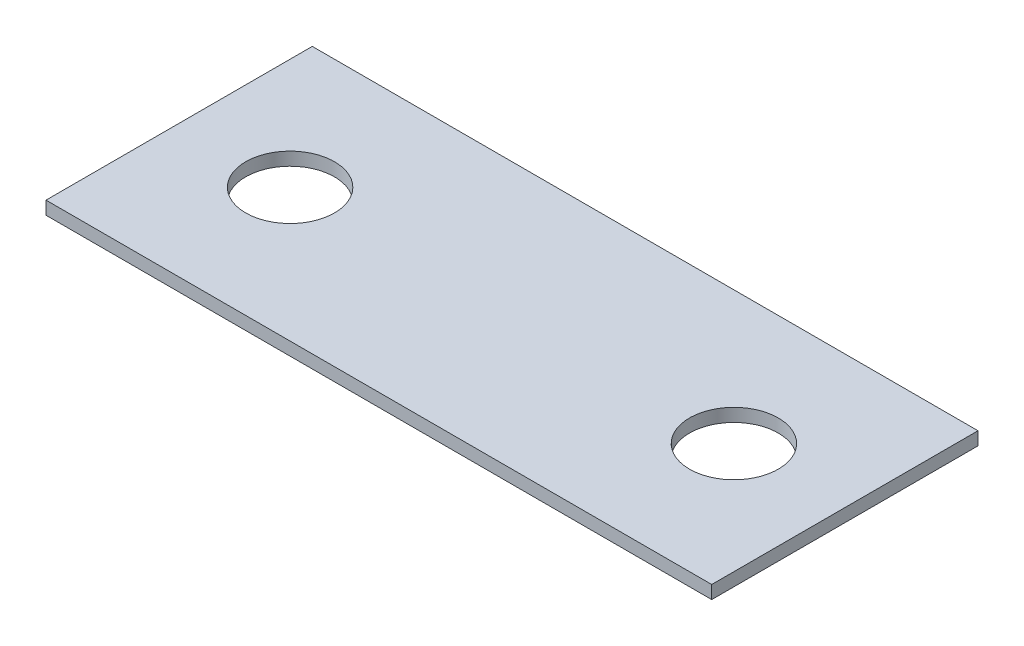
ISO-10303-21;
HEADER;
FILE_DESCRIPTION(('STEP AP214'),'2;1');
FILE_NAME('part.step','',(''),(''),'','','');
FILE_SCHEMA(('AUTOMOTIVE_DESIGN { 1 0 10303 214 1 1 1 1 }'));
ENDSEC;
DATA;
#1=APPLICATION_CONTEXT('core data for automotive mechanical design processes');
#2=APPLICATION_PROTOCOL_DEFINITION('international standard','automotive_design',2000,#1);
#3=PRODUCT_CONTEXT('',#1,'mechanical');
#4=PRODUCT('Part','Part','',(#3));
#5=PRODUCT_RELATED_PRODUCT_CATEGORY('part','',(#4));
#6=PRODUCT_DEFINITION_FORMATION('','',#4);
#7=PRODUCT_DEFINITION_CONTEXT('part definition',#1,'design');
#8=PRODUCT_DEFINITION('design','',#6,#7);
#9=PRODUCT_DEFINITION_SHAPE('','',#8);
#10=(LENGTH_UNIT() NAMED_UNIT(*) SI_UNIT(.MILLI.,.METRE.));
#11=(NAMED_UNIT(*) PLANE_ANGLE_UNIT() SI_UNIT($,.RADIAN.));
#12=(NAMED_UNIT(*) SI_UNIT($,.STERADIAN.) SOLID_ANGLE_UNIT());
#13=UNCERTAINTY_MEASURE_WITH_UNIT(LENGTH_MEASURE(1.E-05),#10,'distance_accuracy_value','');
#14=(GEOMETRIC_REPRESENTATION_CONTEXT(3) GLOBAL_UNCERTAINTY_ASSIGNED_CONTEXT((#13)) GLOBAL_UNIT_ASSIGNED_CONTEXT((#10,
#11,#12)) REPRESENTATION_CONTEXT('',''));
#15=CARTESIAN_POINT('',(0.,0.,0.));
#16=DIRECTION('',(0.,0.,1.));
#17=DIRECTION('',(1.,0.,0.));
#18=AXIS2_PLACEMENT_3D('',#15,#16,#17);
#19=CARTESIAN_POINT('',(0.,0.9375,0.));
#20=DIRECTION('',(1.,0.,0.));
#21=DIRECTION('',(0.,0.,-1.));
#22=AXIS2_PLACEMENT_3D('',#19,#20,#21);
#23=PLANE('',#22);
#24=DIRECTION('',(0.,0.,1.));
#25=VECTOR('',#24,1.);
#26=CARTESIAN_POINT('',(0.,0.,0.));
#27=LINE('',#26,#25);
#28=CARTESIAN_POINT('',(0.,0.,0.));
#29=VERTEX_POINT('',#28);
#30=CARTESIAN_POINT('',(0.,0.,19.05));
#31=VERTEX_POINT('',#30);
#32=EDGE_CURVE('E96',#29,#31,#27,.T.);
#33=ORIENTED_EDGE('',*,*,#32,.T.);
#34=DIRECTION('',(0.,-1.,0.));
#35=VECTOR('',#34,1.);
#36=CARTESIAN_POINT('',(0.,0.9375,19.05));
#37=LINE('',#36,#35);
#38=CARTESIAN_POINT('',(0.,0.9375,19.05));
#39=VERTEX_POINT('',#38);
#40=EDGE_CURVE('E11',#39,#31,#37,.T.);
#41=ORIENTED_EDGE('',*,*,#40,.F.);
#42=DIRECTION('',(0.,0.,1.));
#43=VECTOR('',#42,1.);
#44=CARTESIAN_POINT('',(0.,0.9375,0.));
#45=LINE('',#44,#43);
#46=CARTESIAN_POINT('',(0.,0.9375,0.));
#47=VERTEX_POINT('',#46);
#48=EDGE_CURVE('E84',#47,#39,#45,.T.);
#49=ORIENTED_EDGE('',*,*,#48,.F.);
#50=DIRECTION('',(0.,-1.,0.));
#51=VECTOR('',#50,1.);
#52=CARTESIAN_POINT('',(0.,0.9375,0.));
#53=LINE('',#52,#51);
#54=EDGE_CURVE('E92',#47,#29,#53,.T.);
#55=ORIENTED_EDGE('',*,*,#54,.T.);
#56=EDGE_LOOP('',(#33,#41,#49,#55));
#57=FACE_BOUND('',#56,.T.);
#58=ADVANCED_FACE('F33',(#57),#23,.F.);
#59=CARTESIAN_POINT('',(0.,0.9375,19.05));
#60=DIRECTION('',(0.,0.,-1.));
#61=DIRECTION('',(-1.,0.,0.));
#62=AXIS2_PLACEMENT_3D('',#59,#60,#61);
#63=PLANE('',#62);
#64=DIRECTION('',(1.,0.,0.));
#65=VECTOR('',#64,1.);
#66=CARTESIAN_POINT('',(0.,0.,19.05));
#67=LINE('',#66,#65);
#68=CARTESIAN_POINT('',(47.625,0.,19.05));
#69=VERTEX_POINT('',#68);
#70=EDGE_CURVE('E88',#31,#69,#67,.T.);
#71=ORIENTED_EDGE('',*,*,#70,.T.);
#72=DIRECTION('',(0.,-1.,0.));
#73=VECTOR('',#72,1.);
#74=CARTESIAN_POINT('',(47.625,0.9375,19.05));
#75=LINE('',#74,#73);
#76=CARTESIAN_POINT('',(47.625,0.9375,19.05));
#77=VERTEX_POINT('',#76);
#78=EDGE_CURVE('E41',#77,#69,#75,.T.);
#79=ORIENTED_EDGE('',*,*,#78,.F.);
#80=DIRECTION('',(1.,0.,0.));
#81=VECTOR('',#80,1.);
#82=CARTESIAN_POINT('',(0.,0.9375,19.05));
#83=LINE('',#82,#81);
#84=EDGE_CURVE('E79',#39,#77,#83,.T.);
#85=ORIENTED_EDGE('',*,*,#84,.F.);
#86=ORIENTED_EDGE('',*,*,#40,.T.);
#87=EDGE_LOOP('',(#71,#79,#85,#86));
#88=FACE_BOUND('',#87,.T.);
#89=ADVANCED_FACE('F87',(#88),#63,.F.);
#90=CARTESIAN_POINT('',(47.625,0.9375,0.));
#91=DIRECTION('',(-1.,0.,0.));
#92=DIRECTION('',(0.,0.,1.));
#93=AXIS2_PLACEMENT_3D('',#90,#91,#92);
#94=PLANE('',#93);
#95=DIRECTION('',(0.,0.,-1.));
#96=VECTOR('',#95,1.);
#97=CARTESIAN_POINT('',(47.625,0.,0.));
#98=LINE('',#97,#96);
#99=CARTESIAN_POINT('',(47.625,0.,0.));
#100=VERTEX_POINT('',#99);
#101=EDGE_CURVE('E66',#69,#100,#98,.T.);
#102=ORIENTED_EDGE('',*,*,#101,.T.);
#103=DIRECTION('',(0.,-1.,0.));
#104=VECTOR('',#103,1.);
#105=CARTESIAN_POINT('',(47.625,0.9375,0.));
#106=LINE('',#105,#104);
#107=CARTESIAN_POINT('',(47.625,0.9375,0.));
#108=VERTEX_POINT('',#107);
#109=EDGE_CURVE('E89',#108,#100,#106,.T.);
#110=ORIENTED_EDGE('',*,*,#109,.F.);
#111=DIRECTION('',(0.,0.,-1.));
#112=VECTOR('',#111,1.);
#113=CARTESIAN_POINT('',(47.625,0.9375,0.));
#114=LINE('',#113,#112);
#115=EDGE_CURVE('E82',#77,#108,#114,.T.);
#116=ORIENTED_EDGE('',*,*,#115,.F.);
#117=ORIENTED_EDGE('',*,*,#78,.T.);
#118=EDGE_LOOP('',(#102,#110,#116,#117));
#119=FACE_BOUND('',#118,.T.);
#120=ADVANCED_FACE('F90',(#119),#94,.F.);
#121=CARTESIAN_POINT('',(0.,0.9375,0.));
#122=DIRECTION('',(0.,0.,1.));
#123=DIRECTION('',(1.,0.,0.));
#124=AXIS2_PLACEMENT_3D('',#121,#122,#123);
#125=PLANE('',#124);
#126=DIRECTION('',(-1.,0.,0.));
#127=VECTOR('',#126,1.);
#128=CARTESIAN_POINT('',(0.,0.,0.));
#129=LINE('',#128,#127);
#130=EDGE_CURVE('E72',#100,#29,#129,.T.);
#131=ORIENTED_EDGE('',*,*,#130,.T.);
#132=ORIENTED_EDGE('',*,*,#54,.F.);
#133=DIRECTION('',(-1.,0.,0.));
#134=VECTOR('',#133,1.);
#135=CARTESIAN_POINT('',(0.,0.9375,0.));
#136=LINE('',#135,#134);
#137=EDGE_CURVE('E49',#108,#47,#136,.T.);
#138=ORIENTED_EDGE('',*,*,#137,.F.);
#139=ORIENTED_EDGE('',*,*,#109,.T.);
#140=EDGE_LOOP('',(#131,#132,#138,#139));
#141=FACE_BOUND('',#140,.T.);
#142=ADVANCED_FACE('F104',(#141),#125,.F.);
#143=CARTESIAN_POINT('',(0.,0.9375,0.));
#144=DIRECTION('',(0.,1.,0.));
#145=DIRECTION('',(0.,0.,1.));
#146=AXIS2_PLACEMENT_3D('',#143,#144,#145);
#147=PLANE('',#146);
#148=CARTESIAN_POINT('',(7.9375,0.9375,9.525));
#149=DIRECTION('',(0.,1.,0.));
#150=DIRECTION('',(0.,0.,1.));
#151=AXIS2_PLACEMENT_3D('',#148,#149,#150);
#152=CIRCLE('',#151,3.175);
#153=CARTESIAN_POINT('',(7.9375,0.9375,12.7));
#154=VERTEX_POINT('',#153);
#155=EDGE_CURVE('E113',#154,#154,#152,.T.);
#156=ORIENTED_EDGE('',*,*,#155,.F.);
#157=EDGE_LOOP('',(#156));
#158=FACE_BOUND('',#157,.T.);
#159=CARTESIAN_POINT('',(39.6875,0.9375,9.525));
#160=DIRECTION('',(0.,1.,0.));
#161=DIRECTION('',(0.,0.,1.));
#162=AXIS2_PLACEMENT_3D('',#159,#160,#161);
#163=CIRCLE('',#162,3.17500000000001);
#164=CARTESIAN_POINT('',(39.6875,0.9375,12.7));
#165=VERTEX_POINT('',#164);
#166=EDGE_CURVE('E114',#165,#165,#163,.T.);
#167=ORIENTED_EDGE('',*,*,#166,.F.);
#168=EDGE_LOOP('',(#167));
#169=FACE_BOUND('',#168,.T.);
#170=ORIENTED_EDGE('',*,*,#48,.T.);
#171=ORIENTED_EDGE('',*,*,#84,.T.);
#172=ORIENTED_EDGE('',*,*,#115,.T.);
#173=ORIENTED_EDGE('',*,*,#137,.T.);
#174=EDGE_LOOP('',(#170,#171,#172,#173));
#175=FACE_BOUND('',#174,.T.);
#176=ADVANCED_FACE('F80',(#158,#169,#175),#147,.T.);
#177=CARTESIAN_POINT('',(0.,0.,0.));
#178=DIRECTION('',(0.,1.,0.));
#179=DIRECTION('',(0.,0.,1.));
#180=AXIS2_PLACEMENT_3D('',#177,#178,#179);
#181=PLANE('',#180);
#182=CARTESIAN_POINT('',(7.9375,0.,9.525));
#183=DIRECTION('',(0.,1.,0.));
#184=DIRECTION('',(0.,0.,1.));
#185=AXIS2_PLACEMENT_3D('',#182,#183,#184);
#186=CIRCLE('',#185,3.175);
#187=CARTESIAN_POINT('',(7.9375,0.,12.7));
#188=VERTEX_POINT('',#187);
#189=EDGE_CURVE('E99',#188,#188,#186,.F.);
#190=ORIENTED_EDGE('',*,*,#189,.F.);
#191=EDGE_LOOP('',(#190));
#192=FACE_BOUND('',#191,.T.);
#193=CARTESIAN_POINT('',(39.6875,0.,9.525));
#194=DIRECTION('',(0.,1.,0.));
#195=DIRECTION('',(0.,0.,1.));
#196=AXIS2_PLACEMENT_3D('',#193,#194,#195);
#197=CIRCLE('',#196,3.17500000000001);
#198=CARTESIAN_POINT('',(39.6875,0.,12.7));
#199=VERTEX_POINT('',#198);
#200=EDGE_CURVE('E110',#199,#199,#197,.F.);
#201=ORIENTED_EDGE('',*,*,#200,.F.);
#202=EDGE_LOOP('',(#201));
#203=FACE_BOUND('',#202,.T.);
#204=ORIENTED_EDGE('',*,*,#32,.F.);
#205=ORIENTED_EDGE('',*,*,#130,.F.);
#206=ORIENTED_EDGE('',*,*,#101,.F.);
#207=ORIENTED_EDGE('',*,*,#70,.F.);
#208=EDGE_LOOP('',(#204,#205,#206,#207));
#209=FACE_BOUND('',#208,.T.);
#210=ADVANCED_FACE('F107',(#192,#203,#209),#181,.F.);
#211=CARTESIAN_POINT('',(39.6875,-0.00100000000000002,9.525));
#212=DIRECTION('',(0.,1.,0.));
#213=DIRECTION('',(0.,0.,1.));
#214=AXIS2_PLACEMENT_3D('',#211,#212,#213);
#215=CYLINDRICAL_SURFACE('',#214,3.17500000000001);
#216=ORIENTED_EDGE('',*,*,#166,.T.);
#217=EDGE_LOOP('',(#216));
#218=FACE_BOUND('',#217,.T.);
#219=ORIENTED_EDGE('',*,*,#200,.T.);
#220=EDGE_LOOP('',(#219));
#221=FACE_BOUND('',#220,.T.);
#222=ADVANCED_FACE('F130',(#218,#221),#215,.F.);
#223=CARTESIAN_POINT('',(7.9375,-0.00100000000000002,9.525));
#224=DIRECTION('',(0.,1.,0.));
#225=DIRECTION('',(0.,0.,1.));
#226=AXIS2_PLACEMENT_3D('',#223,#224,#225);
#227=CYLINDRICAL_SURFACE('',#226,3.175);
#228=ORIENTED_EDGE('',*,*,#155,.T.);
#229=EDGE_LOOP('',(#228));
#230=FACE_BOUND('',#229,.T.);
#231=ORIENTED_EDGE('',*,*,#189,.T.);
#232=EDGE_LOOP('',(#231));
#233=FACE_BOUND('',#232,.T.);
#234=ADVANCED_FACE('F122',(#230,#233),#227,.F.);
#235=CLOSED_SHELL('',(#58,#89,#120,#142,#176,#210,#222,#234));
#236=MANIFOLD_SOLID_BREP('B2',#235);
#237=ADVANCED_BREP_SHAPE_REPRESENTATION('',(#18,#236),#14);
#238=SHAPE_DEFINITION_REPRESENTATION(#9,#237);
ENDSEC;
END-ISO-10303-21;
